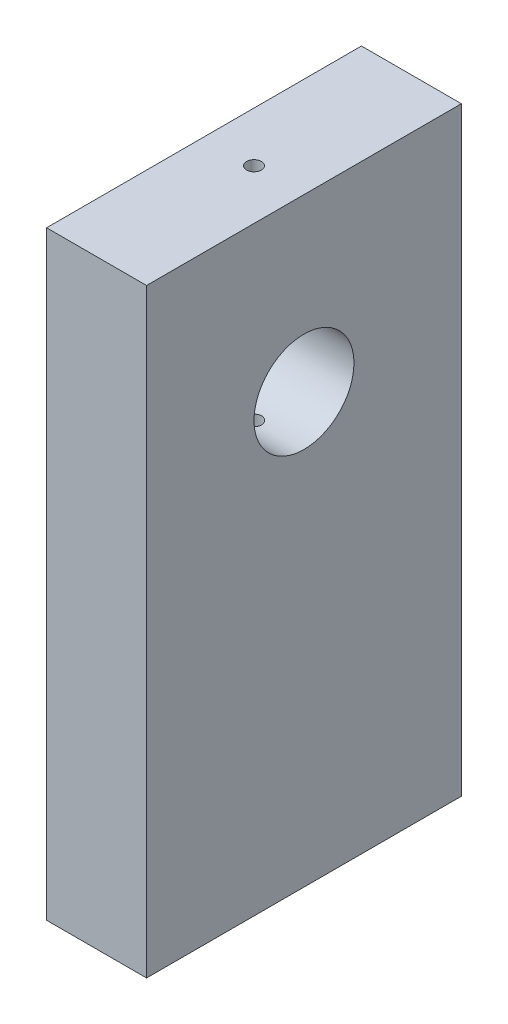
ISO-10303-21;
HEADER;
FILE_DESCRIPTION(('STEP AP214'),'2;1');
FILE_NAME('part.step','',(''),(''),'','','');
FILE_SCHEMA(('AUTOMOTIVE_DESIGN { 1 0 10303 214 1 1 1 1 }'));
ENDSEC;
DATA;
#1=APPLICATION_CONTEXT('core data for automotive mechanical design processes');
#2=APPLICATION_PROTOCOL_DEFINITION('international standard','automotive_design',2000,#1);
#3=PRODUCT_CONTEXT('',#1,'mechanical');
#4=PRODUCT('Part','Part','',(#3));
#5=PRODUCT_RELATED_PRODUCT_CATEGORY('part','',(#4));
#6=PRODUCT_DEFINITION_FORMATION('','',#4);
#7=PRODUCT_DEFINITION_CONTEXT('part definition',#1,'design');
#8=PRODUCT_DEFINITION('design','',#6,#7);
#9=PRODUCT_DEFINITION_SHAPE('','',#8);
#10=(LENGTH_UNIT() NAMED_UNIT(*) SI_UNIT(.MILLI.,.METRE.));
#11=(NAMED_UNIT(*) PLANE_ANGLE_UNIT() SI_UNIT($,.RADIAN.));
#12=(NAMED_UNIT(*) SI_UNIT($,.STERADIAN.) SOLID_ANGLE_UNIT());
#13=UNCERTAINTY_MEASURE_WITH_UNIT(LENGTH_MEASURE(1.E-05),#10,'distance_accuracy_value','');
#14=(GEOMETRIC_REPRESENTATION_CONTEXT(3) GLOBAL_UNCERTAINTY_ASSIGNED_CONTEXT((#13)) GLOBAL_UNIT_ASSIGNED_CONTEXT((#10,
#11,#12)) REPRESENTATION_CONTEXT('',''));
#15=CARTESIAN_POINT('',(0.,0.,0.));
#16=DIRECTION('',(0.,0.,1.));
#17=DIRECTION('',(1.,0.,0.));
#18=AXIS2_PLACEMENT_3D('',#15,#16,#17);
#19=CARTESIAN_POINT('',(0.,76.2,28.0311398221209));
#20=DIRECTION('',(1.,0.,0.));
#21=DIRECTION('',(0.,0.,-1.));
#22=AXIS2_PLACEMENT_3D('',#19,#20,#21);
#23=PLANE('',#22);
#24=CARTESIAN_POINT('',(0.,54.5,8.03113982212091));
#25=DIRECTION('',(1.,0.,0.));
#26=DIRECTION('',(0.,0.,-1.));
#27=AXIS2_PLACEMENT_3D('',#24,#25,#26);
#28=CIRCLE('',#27,6.35);
#29=CARTESIAN_POINT('',(0.,54.5,1.68113982212091));
#30=VERTEX_POINT('',#29);
#31=EDGE_CURVE('E108',#30,#30,#28,.T.);
#32=ORIENTED_EDGE('',*,*,#31,.T.);
#33=EDGE_LOOP('',(#32));
#34=FACE_BOUND('',#33,.T.);
#35=DIRECTION('',(0.,0.,1.));
#36=VECTOR('',#35,1.);
#37=CARTESIAN_POINT('',(0.,0.,28.0311398221209));
#38=LINE('',#37,#36);
#39=CARTESIAN_POINT('',(0.,0.,-11.9688601778791));
#40=VERTEX_POINT('',#39);
#41=CARTESIAN_POINT('',(0.,0.,28.0311398221209));
#42=VERTEX_POINT('',#41);
#43=EDGE_CURVE('E105',#40,#42,#38,.T.);
#44=ORIENTED_EDGE('',*,*,#43,.T.);
#45=DIRECTION('',(0.,-1.,0.));
#46=VECTOR('',#45,1.);
#47=CARTESIAN_POINT('',(0.,76.2,28.0311398221209));
#48=LINE('',#47,#46);
#49=CARTESIAN_POINT('',(0.,76.2,28.0311398221209));
#50=VERTEX_POINT('',#49);
#51=EDGE_CURVE('E11',#50,#42,#48,.T.);
#52=ORIENTED_EDGE('',*,*,#51,.F.);
#53=DIRECTION('',(0.,0.,1.));
#54=VECTOR('',#53,1.);
#55=CARTESIAN_POINT('',(0.,76.2,28.0311398221209));
#56=LINE('',#55,#54);
#57=CARTESIAN_POINT('',(0.,76.2,-11.9688601778791));
#58=VERTEX_POINT('',#57);
#59=EDGE_CURVE('E92',#58,#50,#56,.T.);
#60=ORIENTED_EDGE('',*,*,#59,.F.);
#61=DIRECTION('',(0.,-1.,0.));
#62=VECTOR('',#61,1.);
#63=CARTESIAN_POINT('',(0.,76.2,-11.9688601778791));
#64=LINE('',#63,#62);
#65=EDGE_CURVE('E101',#58,#40,#64,.T.);
#66=ORIENTED_EDGE('',*,*,#65,.T.);
#67=EDGE_LOOP('',(#44,#52,#60,#66));
#68=FACE_BOUND('',#67,.T.);
#69=ADVANCED_FACE('F34',(#34,#68),#23,.F.);
#70=CARTESIAN_POINT('',(0.,76.2,28.0311398221209));
#71=DIRECTION('',(0.,0.,-1.));
#72=DIRECTION('',(-1.,0.,0.));
#73=AXIS2_PLACEMENT_3D('',#70,#71,#72);
#74=PLANE('',#73);
#75=DIRECTION('',(1.,0.,0.));
#76=VECTOR('',#75,1.);
#77=CARTESIAN_POINT('',(0.,0.,28.0311398221209));
#78=LINE('',#77,#76);
#79=CARTESIAN_POINT('',(12.7,0.,28.0311398221209));
#80=VERTEX_POINT('',#79);
#81=EDGE_CURVE('E96',#42,#80,#78,.T.);
#82=ORIENTED_EDGE('',*,*,#81,.T.);
#83=DIRECTION('',(0.,-1.,0.));
#84=VECTOR('',#83,1.);
#85=CARTESIAN_POINT('',(12.7,76.2,28.0311398221209));
#86=LINE('',#85,#84);
#87=CARTESIAN_POINT('',(12.7,76.2,28.0311398221209));
#88=VERTEX_POINT('',#87);
#89=EDGE_CURVE('E48',#88,#80,#86,.T.);
#90=ORIENTED_EDGE('',*,*,#89,.F.);
#91=DIRECTION('',(1.,0.,0.));
#92=VECTOR('',#91,1.);
#93=CARTESIAN_POINT('',(0.,76.2,28.0311398221209));
#94=LINE('',#93,#92);
#95=EDGE_CURVE('E87',#50,#88,#94,.T.);
#96=ORIENTED_EDGE('',*,*,#95,.F.);
#97=ORIENTED_EDGE('',*,*,#51,.T.);
#98=EDGE_LOOP('',(#82,#90,#96,#97));
#99=FACE_BOUND('',#98,.T.);
#100=ADVANCED_FACE('F95',(#99),#74,.F.);
#101=CARTESIAN_POINT('',(12.7,76.2,28.0311398221209));
#102=DIRECTION('',(-1.,0.,0.));
#103=DIRECTION('',(0.,0.,1.));
#104=AXIS2_PLACEMENT_3D('',#101,#102,#103);
#105=PLANE('',#104);
#106=CARTESIAN_POINT('',(12.7,54.5,8.03113982212092));
#107=DIRECTION('',(1.,0.,0.));
#108=DIRECTION('',(0.,0.,-1.));
#109=AXIS2_PLACEMENT_3D('',#106,#107,#108);
#110=CIRCLE('',#109,6.35);
#111=CARTESIAN_POINT('',(12.7,54.5,1.68113982212092));
#112=VERTEX_POINT('',#111);
#113=EDGE_CURVE('E183',#112,#112,#110,.T.);
#114=ORIENTED_EDGE('',*,*,#113,.F.);
#115=EDGE_LOOP('',(#114));
#116=FACE_BOUND('',#115,.T.);
#117=DIRECTION('',(0.,0.,-1.));
#118=VECTOR('',#117,1.);
#119=CARTESIAN_POINT('',(12.7,0.,28.0311398221209));
#120=LINE('',#119,#118);
#121=CARTESIAN_POINT('',(12.7,0.,-11.9688601778791));
#122=VERTEX_POINT('',#121);
#123=EDGE_CURVE('E74',#80,#122,#120,.T.);
#124=ORIENTED_EDGE('',*,*,#123,.T.);
#125=DIRECTION('',(0.,-1.,0.));
#126=VECTOR('',#125,1.);
#127=CARTESIAN_POINT('',(12.7,76.2,-11.9688601778791));
#128=LINE('',#127,#126);
#129=CARTESIAN_POINT('',(12.7,76.2,-11.9688601778791));
#130=VERTEX_POINT('',#129);
#131=EDGE_CURVE('E97',#130,#122,#128,.T.);
#132=ORIENTED_EDGE('',*,*,#131,.F.);
#133=DIRECTION('',(0.,0.,-1.));
#134=VECTOR('',#133,1.);
#135=CARTESIAN_POINT('',(12.7,76.2,28.0311398221209));
#136=LINE('',#135,#134);
#137=EDGE_CURVE('E90',#88,#130,#136,.T.);
#138=ORIENTED_EDGE('',*,*,#137,.F.);
#139=ORIENTED_EDGE('',*,*,#89,.T.);
#140=EDGE_LOOP('',(#124,#132,#138,#139));
#141=FACE_BOUND('',#140,.T.);
#142=ADVANCED_FACE('F99',(#116,#141),#105,.F.);
#143=CARTESIAN_POINT('',(0.,76.2,-11.9688601778791));
#144=DIRECTION('',(0.,0.,1.));
#145=DIRECTION('',(1.,0.,0.));
#146=AXIS2_PLACEMENT_3D('',#143,#144,#145);
#147=PLANE('',#146);
#148=DIRECTION('',(-1.,0.,0.));
#149=VECTOR('',#148,1.);
#150=CARTESIAN_POINT('',(0.,0.,-11.9688601778791));
#151=LINE('',#150,#149);
#152=EDGE_CURVE('E80',#122,#40,#151,.T.);
#153=ORIENTED_EDGE('',*,*,#152,.T.);
#154=ORIENTED_EDGE('',*,*,#65,.F.);
#155=DIRECTION('',(-1.,0.,0.));
#156=VECTOR('',#155,1.);
#157=CARTESIAN_POINT('',(0.,76.2,-11.9688601778791));
#158=LINE('',#157,#156);
#159=EDGE_CURVE('E57',#130,#58,#158,.T.);
#160=ORIENTED_EDGE('',*,*,#159,.F.);
#161=ORIENTED_EDGE('',*,*,#131,.T.);
#162=EDGE_LOOP('',(#153,#154,#160,#161));
#163=FACE_BOUND('',#162,.T.);
#164=ADVANCED_FACE('F170',(#163),#147,.F.);
#165=CARTESIAN_POINT('',(0.,76.2,0.));
#166=DIRECTION('',(0.,-1.,0.));
#167=DIRECTION('',(0.,0.,-1.));
#168=AXIS2_PLACEMENT_3D('',#165,#166,#167);
#169=PLANE('',#168);
#170=CARTESIAN_POINT('',(6.35,76.2,8.03113982212091));
#171=DIRECTION('',(0.,1.,0.));
#172=DIRECTION('',(0.,0.,1.));
#173=AXIS2_PLACEMENT_3D('',#170,#171,#172);
#174=CIRCLE('',#173,0.95);
#175=CARTESIAN_POINT('',(6.35,76.2,8.98113982212091));
#176=VERTEX_POINT('',#175);
#177=EDGE_CURVE('E189',#176,#176,#174,.T.);
#178=ORIENTED_EDGE('',*,*,#177,.F.);
#179=EDGE_LOOP('',(#178));
#180=FACE_BOUND('',#179,.T.);
#181=ORIENTED_EDGE('',*,*,#59,.T.);
#182=ORIENTED_EDGE('',*,*,#95,.T.);
#183=ORIENTED_EDGE('',*,*,#137,.T.);
#184=ORIENTED_EDGE('',*,*,#159,.T.);
#185=EDGE_LOOP('',(#181,#182,#183,#184));
#186=FACE_BOUND('',#185,.T.);
#187=ADVANCED_FACE('F88',(#180,#186),#169,.F.);
#188=CARTESIAN_POINT('',(0.,0.,0.));
#189=DIRECTION('',(0.,-1.,0.));
#190=DIRECTION('',(0.,0.,-1.));
#191=AXIS2_PLACEMENT_3D('',#188,#189,#190);
#192=PLANE('',#191);
#193=CARTESIAN_POINT('',(6.35,0.,1.36413982212091));
#194=DIRECTION('',(0.,-1.,0.));
#195=DIRECTION('',(0.,0.,-1.));
#196=AXIS2_PLACEMENT_3D('',#193,#194,#195);
#197=CIRCLE('',#196,0.949999999999999);
#198=CARTESIAN_POINT('',(6.35,0.,0.414139822120907));
#199=VERTEX_POINT('',#198);
#200=EDGE_CURVE('E201',#199,#199,#197,.T.);
#201=ORIENTED_EDGE('',*,*,#200,.F.);
#202=EDGE_LOOP('',(#201));
#203=FACE_BOUND('',#202,.T.);
#204=CARTESIAN_POINT('',(6.35,0.,14.6981398221209));
#205=DIRECTION('',(0.,-1.,0.));
#206=DIRECTION('',(0.,0.,-1.));
#207=AXIS2_PLACEMENT_3D('',#204,#205,#206);
#208=CIRCLE('',#207,0.949999999999999);
#209=CARTESIAN_POINT('',(6.35,0.,13.7481398221209));
#210=VERTEX_POINT('',#209);
#211=EDGE_CURVE('E195',#210,#210,#208,.T.);
#212=ORIENTED_EDGE('',*,*,#211,.F.);
#213=EDGE_LOOP('',(#212));
#214=FACE_BOUND('',#213,.T.);
#215=ORIENTED_EDGE('',*,*,#43,.F.);
#216=ORIENTED_EDGE('',*,*,#152,.F.);
#217=ORIENTED_EDGE('',*,*,#123,.F.);
#218=ORIENTED_EDGE('',*,*,#81,.F.);
#219=EDGE_LOOP('',(#215,#216,#217,#218));
#220=FACE_BOUND('',#219,.T.);
#221=ADVANCED_FACE('F161',(#203,#214,#220),#192,.T.);
#222=CARTESIAN_POINT('',(0.,54.5,8.03113982212091));
#223=DIRECTION('',(1.,0.,0.));
#224=DIRECTION('',(0.,0.,-1.));
#225=AXIS2_PLACEMENT_3D('',#222,#223,#224);
#226=CYLINDRICAL_SURFACE('',#225,6.35);
#227=CARTESIAN_POINT('',(6.35,48.2214651390631,8.98113982212091));
#228=CARTESIAN_POINT('',(6.29695944050904,48.2214642541504,8.98113763017558));
#229=CARTESIAN_POINT('',(6.24388805166467,48.220785742529,8.9766827475789));
#230=CARTESIAN_POINT('',(6.13922897763603,48.2181468334334,8.95898558856856));
#231=CARTESIAN_POINT('',(6.08764279279286,48.2161851841202,8.94573473054591));
#232=CARTESIAN_POINT('',(5.98748419818778,48.2112070403444,8.91085083118381));
#233=CARTESIAN_POINT('',(5.93890951307246,48.2081913539881,8.88922420998365));
#234=CARTESIAN_POINT('',(5.84608536614171,48.2014458882347,8.83821777733549));
#235=CARTESIAN_POINT('',(5.80183530757803,48.1977162075713,8.80883903766573));
#236=CARTESIAN_POINT('',(5.71855717925139,48.1899297791387,8.7429124103493));
#237=CARTESIAN_POINT('',(5.67956854839338,48.1858708910181,8.70631495027158));
#238=CARTESIAN_POINT('',(5.60826177064337,48.1779024882952,8.6270967847413));
#239=CARTESIAN_POINT('',(5.57594398990584,48.1739929819018,8.58447574887853));
#240=CARTESIAN_POINT('',(5.51875085220531,48.1667414547173,8.49416771409972));
#241=CARTESIAN_POINT('',(5.49391180195969,48.1634022353278,8.44645747759593));
#242=CARTESIAN_POINT('',(5.45261420074565,48.1576912242777,8.34748393334747));
#243=CARTESIAN_POINT('',(5.43615520924314,48.1553193817641,8.29622081253655));
#244=CARTESIAN_POINT('',(5.41220446108994,48.1518254657755,8.19200278371624));
#245=CARTESIAN_POINT('',(5.40464667091787,48.1506941935128,8.13906336450344));
#246=CARTESIAN_POINT('',(5.39850783135176,48.1497773568818,8.03265648155445));
#247=CARTESIAN_POINT('',(5.3999262854261,48.1499917180781,7.97918904718939));
#248=CARTESIAN_POINT('',(5.41164754458788,48.1517346441019,7.8736943778446));
#249=CARTESIAN_POINT('',(5.42187930811867,48.1532526999295,7.82165905133832));
#250=CARTESIAN_POINT('',(5.45082523923659,48.1574207351315,7.72005231807688));
#251=CARTESIAN_POINT('',(5.46953962421231,48.160070743515,7.67048097450363));
#252=CARTESIAN_POINT('',(5.51499234173793,48.1662229877349,7.57499424718532));
#253=CARTESIAN_POINT('',(5.54176059569328,48.1697283921646,7.52909331881497));
#254=CARTESIAN_POINT('',(5.60253935391812,48.1772007296619,7.44240800089341));
#255=CARTESIAN_POINT('',(5.63655033244988,48.1811676929452,7.40162394667929));
#256=CARTESIAN_POINT('',(5.71124488252164,48.1891665270761,7.32591134629481));
#257=CARTESIAN_POINT('',(5.75199047700879,48.1931986532478,7.29104398795087));
#258=CARTESIAN_POINT('',(5.83878687652127,48.2008355018972,7.22863229814654));
#259=CARTESIAN_POINT('',(5.88483771389023,48.204440221769,7.20108801133496));
#260=CARTESIAN_POINT('',(5.98100100946922,48.2108140502121,7.15409615641868));
#261=CARTESIAN_POINT('',(6.03111657542702,48.2135825116228,7.13465485462588));
#262=CARTESIAN_POINT('',(6.13395223468854,48.2179588962068,7.10448227676795));
#263=CARTESIAN_POINT('',(6.18667214517011,48.2195669007195,7.0937503902305));
#264=CARTESIAN_POINT('',(6.29267563893605,48.2214248929145,7.08138515129504));
#265=CARTESIAN_POINT('',(6.34594888654339,48.2216878246573,7.07966507153335));
#266=CARTESIAN_POINT('',(6.45202290248653,48.2208602650969,7.08514216749058));
#267=CARTESIAN_POINT('',(6.5048236853527,48.2197698155611,7.09233906801737));
#268=CARTESIAN_POINT('',(6.60818541350141,48.2163702492639,7.1153722839069));
#269=CARTESIAN_POINT('',(6.6587562007361,48.2140672263866,7.13116541153345));
#270=CARTESIAN_POINT('',(6.75653276490395,48.2085070311314,7.17089785519443));
#271=CARTESIAN_POINT('',(6.80373837631714,48.2052498118606,7.19483757159413));
#272=CARTESIAN_POINT('',(6.89383342892606,48.1981177274387,7.2503920889631));
#273=CARTESIAN_POINT('',(6.93668788674272,48.1942384180548,7.28206304352649));
#274=CARTESIAN_POINT('',(7.01650457433138,48.1863126500114,7.35210293033033));
#275=CARTESIAN_POINT('',(7.05346647250281,48.1822661819612,7.39047223926262));
#276=CARTESIAN_POINT('',(7.12076017993331,48.1744215899789,7.47320156237177));
#277=CARTESIAN_POINT('',(7.15103452180125,48.1706258013322,7.51760857582116));
#278=CARTESIAN_POINT('',(7.20369340246693,48.1637465196142,7.61092833261962));
#279=CARTESIAN_POINT('',(7.22607815618529,48.1606630071407,7.65984095318545));
#280=CARTESIAN_POINT('',(7.26223056581287,48.155565941014,7.76060385634704));
#281=CARTESIAN_POINT('',(7.27602967346064,48.1535484862236,7.8124426487991));
#282=CARTESIAN_POINT('',(7.29472087942889,48.1507944755807,7.91773404616642));
#283=CARTESIAN_POINT('',(7.29961356280087,48.1500578355933,7.97118654484488));
#284=CARTESIAN_POINT('',(7.30033881254923,48.1499492894961,8.07763059720882));
#285=CARTESIAN_POINT('',(7.29625932045422,48.1505641366386,8.13062155920452));
#286=CARTESIAN_POINT('',(7.27934448116428,48.1530627741379,8.23515500323407));
#287=CARTESIAN_POINT('',(7.26650916155902,48.1549465604963,8.28669748983154));
#288=CARTESIAN_POINT('',(7.23247815291329,48.1597723880404,8.3868469443731));
#289=CARTESIAN_POINT('',(7.21128852144323,48.1627136623236,8.43545600991028));
#290=CARTESIAN_POINT('',(7.16115976267356,48.1693313620588,8.52844258764614));
#291=CARTESIAN_POINT('',(7.13222038643604,48.1730078111252,8.57281996385206));
#292=CARTESIAN_POINT('',(7.06709551290929,48.1807299691893,8.65652954804012));
#293=CARTESIAN_POINT('',(7.03084507650451,48.1847787967126,8.69581095123261));
#294=CARTESIAN_POINT('',(6.95226370620136,48.1927662855605,8.76776518260966));
#295=CARTESIAN_POINT('',(6.90993134702199,48.1967049208027,8.80043645739562));
#296=CARTESIAN_POINT('',(6.8201097644222,48.2040496791568,8.85840681111266));
#297=CARTESIAN_POINT('',(6.77259304742203,48.2074527037419,8.88366367587567));
#298=CARTESIAN_POINT('',(6.67396349208461,48.2133046055472,8.9258003726782));
#299=CARTESIAN_POINT('',(6.62285445210588,48.2157544731937,8.94268890528006));
#300=CARTESIAN_POINT('',(6.53459609651562,48.2188561873119,8.96377316812267));
#301=CARTESIAN_POINT('',(6.49799208756663,48.2198293621235,8.97027570869853));
#302=CARTESIAN_POINT('',(6.42426375307134,48.2211341436864,8.97895977532955));
#303=CARTESIAN_POINT('',(6.3871394342208,48.2214657586862,8.98114135693898));
#304=CARTESIAN_POINT('',(6.35,48.2214651390631,8.98113982212091));
#305=B_SPLINE_CURVE_WITH_KNOTS('',3,(#227,#228,#229,#230,#231,#232,#233,#234,#235,#236,#237,
#238,#239,#240,#241,#242,#243,#244,#245,#246,#247,#248,#249,#250,#251,#252,#253,#254,#255,#256,
#257,#258,#259,#260,#261,#262,#263,#264,#265,#266,#267,#268,#269,#270,#271,#272,#273,#274,#275,
#276,#277,#278,#279,#280,#281,#282,#283,#284,#285,#286,#287,#288,#289,#290,#291,#292,#293,#294,
#295,#296,#297,#298,#299,#300,#301,#302,#303,#304),.UNSPECIFIED.,.T.,.F.,(4,2,2,2,2,2,2,2,2,2,2,
2,2,2,2,2,2,2,2,2,2,2,2,2,2,2,2,2,2,2,2,2,2,2,2,2,2,2,4),(0.,0.158985930727143,
0.318127201168327,0.477146728266471,0.636144281442417,0.796274307839144,0.956413121233524,
1.11731726432722,1.27821294792418,1.43790735502968,1.5975929285267,1.75600324109659,
1.91441761356022,2.07342794436333,2.23244869055634,2.39302513833747,2.55360256513159,
2.71430394249025,2.87499405477368,3.03413484682635,3.1932707276647,3.3516143864918,
3.50996582826474,3.6695035437727,3.82905023401156,3.98991876845858,4.15078292033991,
4.31105425545261,4.47131506216836,4.63001206571959,4.78870856921767,4.94729021555862,
5.10587695648277,5.26593981086267,5.42604023687997,5.58703526585524,5.74786255508318,
5.85918723736514,5.97051048834403),.UNSPECIFIED.);
#306=CARTESIAN_POINT('',(6.35,48.2214651390631,8.98113982212091));
#307=VERTEX_POINT('',#306);
#308=EDGE_CURVE('E37',#307,#307,#305,.T.);
#309=ORIENTED_EDGE('',*,*,#308,.T.);
#310=EDGE_LOOP('',(#309));
#311=FACE_BOUND('',#310,.T.);
#312=CARTESIAN_POINT('',(6.35,60.7785348609369,8.98113982212091));
#313=CARTESIAN_POINT('',(6.40304055949096,60.7785357458496,8.98113763017558));
#314=CARTESIAN_POINT('',(6.45611194833533,60.779214257471,8.9766827475789));
#315=CARTESIAN_POINT('',(6.56077102236397,60.7818531665665,8.95898558856856));
#316=CARTESIAN_POINT('',(6.61235720720714,60.7838148158798,8.94573473054591));
#317=CARTESIAN_POINT('',(6.71251580181222,60.7887929596556,8.91085083118381));
#318=CARTESIAN_POINT('',(6.76109048692754,60.7918086460119,8.88922420998365));
#319=CARTESIAN_POINT('',(6.85391463385829,60.7985541117652,8.83821777733549));
#320=CARTESIAN_POINT('',(6.89816469242197,60.8022837924287,8.80883903766573));
#321=CARTESIAN_POINT('',(6.98144282074861,60.8100702208613,8.7429124103493));
#322=CARTESIAN_POINT('',(7.02043145160661,60.8141291089819,8.70631495027158));
#323=CARTESIAN_POINT('',(7.09173822935663,60.8220975117048,8.6270967847413));
#324=CARTESIAN_POINT('',(7.12405601009416,60.8260070180982,8.58447574887853));
#325=CARTESIAN_POINT('',(7.18124914779469,60.8332585452827,8.49416771409972));
#326=CARTESIAN_POINT('',(7.20608819804031,60.8365977646722,8.44645747759593));
#327=CARTESIAN_POINT('',(7.24738579925435,60.8423087757223,8.34748393334747));
#328=CARTESIAN_POINT('',(7.26384479075686,60.8446806182359,8.29622081253655));
#329=CARTESIAN_POINT('',(7.28779553891006,60.8481745342245,8.19200278371624));
#330=CARTESIAN_POINT('',(7.29535332908213,60.8493058064872,8.13906336450344));
#331=CARTESIAN_POINT('',(7.30149216864824,60.8502226431182,8.03265648155445));
#332=CARTESIAN_POINT('',(7.3000737145739,60.8500082819219,7.97918904718939));
#333=CARTESIAN_POINT('',(7.28835245541212,60.8482653558981,7.8736943778446));
#334=CARTESIAN_POINT('',(7.27812069188133,60.8467473000705,7.82165905133832));
#335=CARTESIAN_POINT('',(7.24917476076341,60.8425792648684,7.72005231807688));
#336=CARTESIAN_POINT('',(7.23046037578769,60.839929256485,7.67048097450363));
#337=CARTESIAN_POINT('',(7.18500765826207,60.8337770122651,7.57499424718532));
#338=CARTESIAN_POINT('',(7.15823940430672,60.8302716078354,7.52909331881497));
#339=CARTESIAN_POINT('',(7.09746064608188,60.8227992703381,7.44240800089341));
#340=CARTESIAN_POINT('',(7.06344966755012,60.8188323070548,7.40162394667929));
#341=CARTESIAN_POINT('',(6.98875511747836,60.8108334729239,7.32591134629481));
#342=CARTESIAN_POINT('',(6.94800952299121,60.8068013467522,7.29104398795087));
#343=CARTESIAN_POINT('',(6.86121312347873,60.7991644981028,7.22863229814654));
#344=CARTESIAN_POINT('',(6.81516228610977,60.795559778231,7.20108801133496));
#345=CARTESIAN_POINT('',(6.71899899053078,60.7891859497879,7.15409615641868));
#346=CARTESIAN_POINT('',(6.66888342457298,60.7864174883772,7.13465485462588));
#347=CARTESIAN_POINT('',(6.56604776531146,60.7820411037932,7.10448227676795));
#348=CARTESIAN_POINT('',(6.51332785482989,60.7804330992805,7.0937503902305));
#349=CARTESIAN_POINT('',(6.40732436106395,60.7785751070855,7.08138515129504));
#350=CARTESIAN_POINT('',(6.35405111345661,60.7783121753427,7.07966507153335));
#351=CARTESIAN_POINT('',(6.24797709751346,60.7791397349031,7.08514216749058));
#352=CARTESIAN_POINT('',(6.1951763146473,60.7802301844388,7.09233906801737));
#353=CARTESIAN_POINT('',(6.09181458649859,60.7836297507361,7.1153722839069));
#354=CARTESIAN_POINT('',(6.0412437992639,60.7859327736134,7.13116541153345));
#355=CARTESIAN_POINT('',(5.94346723509605,60.7914929688685,7.17089785519443));
#356=CARTESIAN_POINT('',(5.89626162368286,60.7947501881393,7.19483757159413));
#357=CARTESIAN_POINT('',(5.80616657107394,60.8018822725613,7.2503920889631));
#358=CARTESIAN_POINT('',(5.76331211325728,60.8057615819451,7.28206304352649));
#359=CARTESIAN_POINT('',(5.68349542566862,60.8136873499886,7.35210293033033));
#360=CARTESIAN_POINT('',(5.64653352749719,60.8177338180388,7.39047223926262));
#361=CARTESIAN_POINT('',(5.57923982006669,60.825578410021,7.47320156237177));
#362=CARTESIAN_POINT('',(5.54896547819875,60.8293741986678,7.51760857582116));
#363=CARTESIAN_POINT('',(5.49630659753307,60.8362534803858,7.61092833261962));
#364=CARTESIAN_POINT('',(5.47392184381471,60.8393369928593,7.65984095318545));
#365=CARTESIAN_POINT('',(5.43776943418713,60.844434058986,7.76060385634704));
#366=CARTESIAN_POINT('',(5.42397032653936,60.8464515137764,7.8124426487991));
#367=CARTESIAN_POINT('',(5.40527912057111,60.8492055244193,7.91773404616642));
#368=CARTESIAN_POINT('',(5.40038643719913,60.8499421644067,7.97118654484488));
#369=CARTESIAN_POINT('',(5.39966118745077,60.8500507105039,8.07763059720882));
#370=CARTESIAN_POINT('',(5.40374067954578,60.8494358633614,8.13062155920452));
#371=CARTESIAN_POINT('',(5.42065551883572,60.8469372258621,8.23515500323407));
#372=CARTESIAN_POINT('',(5.43349083844098,60.8450534395037,8.28669748983154));
#373=CARTESIAN_POINT('',(5.46752184708671,60.8402276119596,8.3868469443731));
#374=CARTESIAN_POINT('',(5.48871147855677,60.8372863376764,8.43545600991028));
#375=CARTESIAN_POINT('',(5.53884023732644,60.8306686379412,8.52844258764614));
#376=CARTESIAN_POINT('',(5.56777961356396,60.8269921888748,8.57281996385206));
#377=CARTESIAN_POINT('',(5.63290448709071,60.8192700308107,8.65652954804012));
#378=CARTESIAN_POINT('',(5.66915492349549,60.8152212032874,8.69581095123261));
#379=CARTESIAN_POINT('',(5.74773629379864,60.8072337144395,8.76776518260966));
#380=CARTESIAN_POINT('',(5.79006865297801,60.8032950791973,8.80043645739562));
#381=CARTESIAN_POINT('',(5.8798902355778,60.7959503208431,8.85840681111266));
#382=CARTESIAN_POINT('',(5.92740695257797,60.7925472962581,8.88366367587567));
#383=CARTESIAN_POINT('',(6.02603650791539,60.7866953944528,8.9258003726782));
#384=CARTESIAN_POINT('',(6.07714554789412,60.7842455268062,8.94268890528006));
#385=CARTESIAN_POINT('',(6.16540390348438,60.7811438126881,8.96377316812267));
#386=CARTESIAN_POINT('',(6.20200791243337,60.7801706378765,8.97027570869853));
#387=CARTESIAN_POINT('',(6.27573624692866,60.7788658563136,8.97895977532955));
#388=CARTESIAN_POINT('',(6.3128605657792,60.7785342413138,8.98114135693898));
#389=CARTESIAN_POINT('',(6.35,60.7785348609369,8.98113982212091));
#390=B_SPLINE_CURVE_WITH_KNOTS('',3,(#312,#313,#314,#315,#316,#317,#318,#319,#320,#321,#322,
#323,#324,#325,#326,#327,#328,#329,#330,#331,#332,#333,#334,#335,#336,#337,#338,#339,#340,#341,
#342,#343,#344,#345,#346,#347,#348,#349,#350,#351,#352,#353,#354,#355,#356,#357,#358,#359,#360,
#361,#362,#363,#364,#365,#366,#367,#368,#369,#370,#371,#372,#373,#374,#375,#376,#377,#378,#379,
#380,#381,#382,#383,#384,#385,#386,#387,#388,#389),.UNSPECIFIED.,.T.,.F.,(4,2,2,2,2,2,2,2,2,2,2,
2,2,2,2,2,2,2,2,2,2,2,2,2,2,2,2,2,2,2,2,2,2,2,2,2,2,2,4),(0.,0.158985930727143,
0.318127201168327,0.47714672826647,0.636144281442417,0.796274307839144,0.956413121233524,
1.11731726432722,1.27821294792418,1.43790735502968,1.5975929285267,1.75600324109659,
1.91441761356022,2.07342794436333,2.23244869055634,2.39302513833747,2.55360256513159,
2.71430394249025,2.87499405477368,3.03413484682635,3.1932707276647,3.3516143864918,
3.50996582826474,3.6695035437727,3.82905023401156,3.98991876845858,4.15078292033991,
4.31105425545261,4.47131506216836,4.63001206571959,4.78870856921767,4.94729021555862,
5.10587695648277,5.26593981086267,5.42604023687997,5.58703526585524,5.74786255508318,
5.85918723736514,5.97051048834403),.UNSPECIFIED.);
#391=CARTESIAN_POINT('',(6.35,60.7785348609369,8.98113982212091));
#392=VERTEX_POINT('',#391);
#393=EDGE_CURVE('E113',#392,#392,#390,.T.);
#394=ORIENTED_EDGE('',*,*,#393,.T.);
#395=EDGE_LOOP('',(#394));
#396=FACE_BOUND('',#395,.T.);
#397=ORIENTED_EDGE('',*,*,#31,.F.);
#398=EDGE_LOOP('',(#397));
#399=FACE_BOUND('',#398,.T.);
#400=ORIENTED_EDGE('',*,*,#113,.T.);
#401=EDGE_LOOP('',(#400));
#402=FACE_BOUND('',#401,.T.);
#403=ADVANCED_FACE('F119',(#311,#396,#399,#402),#226,.F.);
#404=CARTESIAN_POINT('',(6.35,46.2,8.03113982212091));
#405=DIRECTION('',(0.,1.,0.));
#406=DIRECTION('',(0.,0.,1.));
#407=AXIS2_PLACEMENT_3D('',#404,#405,#406);
#408=CYLINDRICAL_SURFACE('',#407,0.95);
#409=ORIENTED_EDGE('',*,*,#177,.T.);
#410=EDGE_LOOP('',(#409));
#411=FACE_BOUND('',#410,.T.);
#412=ORIENTED_EDGE('',*,*,#393,.F.);
#413=EDGE_LOOP('',(#412));
#414=FACE_BOUND('',#413,.T.);
#415=ADVANCED_FACE('F127',(#411,#414),#408,.F.);
#416=CARTESIAN_POINT('',(6.35,46.2,8.03113982212091));
#417=DIRECTION('',(0.,1.,0.));
#418=DIRECTION('',(0.,0.,1.));
#419=AXIS2_PLACEMENT_3D('',#416,#417,#418);
#420=CIRCLE('',#419,0.95);
#421=CARTESIAN_POINT('',(6.35,46.2,8.98113982212091));
#422=VERTEX_POINT('',#421);
#423=EDGE_CURVE('E118',#422,#422,#420,.T.);
#424=ORIENTED_EDGE('',*,*,#423,.F.);
#425=EDGE_LOOP('',(#424));
#426=FACE_BOUND('',#425,.T.);
#427=ORIENTED_EDGE('',*,*,#308,.F.);
#428=EDGE_LOOP('',(#427));
#429=FACE_BOUND('',#428,.T.);
#430=ADVANCED_FACE('F122',(#426,#429),#408,.F.);
#431=CARTESIAN_POINT('',(6.35,46.2,8.03113982212091));
#432=DIRECTION('',(0.,1.,0.));
#433=DIRECTION('',(0.,0.,1.));
#434=AXIS2_PLACEMENT_3D('',#431,#432,#433);
#435=PLANE('',#434);
#436=ORIENTED_EDGE('',*,*,#423,.T.);
#437=EDGE_LOOP('',(#436));
#438=FACE_BOUND('',#437,.T.);
#439=ADVANCED_FACE('F126',(#438),#435,.T.);
#440=CARTESIAN_POINT('',(6.35,21.,14.6981398221209));
#441=DIRECTION('',(0.,-1.,0.));
#442=DIRECTION('',(0.,0.,-1.));
#443=AXIS2_PLACEMENT_3D('',#440,#441,#442);
#444=CYLINDRICAL_SURFACE('',#443,0.949999999999999);
#445=CARTESIAN_POINT('',(6.35,21.,14.6981398221209));
#446=DIRECTION('',(0.,-1.,0.));
#447=DIRECTION('',(0.,0.,-1.));
#448=AXIS2_PLACEMENT_3D('',#445,#446,#447);
#449=CIRCLE('',#448,0.949999999999999);
#450=CARTESIAN_POINT('',(6.35,21.,13.7481398221209));
#451=VERTEX_POINT('',#450);
#452=EDGE_CURVE('E192',#451,#451,#449,.T.);
#453=ORIENTED_EDGE('',*,*,#452,.F.);
#454=EDGE_LOOP('',(#453));
#455=FACE_BOUND('',#454,.T.);
#456=ORIENTED_EDGE('',*,*,#211,.T.);
#457=EDGE_LOOP('',(#456));
#458=FACE_BOUND('',#457,.T.);
#459=ADVANCED_FACE('F132',(#455,#458),#444,.F.);
#460=CARTESIAN_POINT('',(6.35,21.,14.6981398221209));
#461=DIRECTION('',(0.,-1.,0.));
#462=DIRECTION('',(0.,0.,-1.));
#463=AXIS2_PLACEMENT_3D('',#460,#461,#462);
#464=PLANE('',#463);
#465=ORIENTED_EDGE('',*,*,#452,.T.);
#466=EDGE_LOOP('',(#465));
#467=FACE_BOUND('',#466,.T.);
#468=ADVANCED_FACE('F136',(#467),#464,.T.);
#469=CARTESIAN_POINT('',(6.35,21.,1.36413982212091));
#470=DIRECTION('',(0.,-1.,0.));
#471=DIRECTION('',(0.,0.,-1.));
#472=AXIS2_PLACEMENT_3D('',#469,#470,#471);
#473=CYLINDRICAL_SURFACE('',#472,0.949999999999999);
#474=CARTESIAN_POINT('',(6.35,21.,1.36413982212091));
#475=DIRECTION('',(0.,-1.,0.));
#476=DIRECTION('',(0.,0.,-1.));
#477=AXIS2_PLACEMENT_3D('',#474,#475,#476);
#478=CIRCLE('',#477,0.949999999999999);
#479=CARTESIAN_POINT('',(6.35,21.,0.414139822120907));
#480=VERTEX_POINT('',#479);
#481=EDGE_CURVE('E198',#480,#480,#478,.T.);
#482=ORIENTED_EDGE('',*,*,#481,.F.);
#483=EDGE_LOOP('',(#482));
#484=FACE_BOUND('',#483,.T.);
#485=ORIENTED_EDGE('',*,*,#200,.T.);
#486=EDGE_LOOP('',(#485));
#487=FACE_BOUND('',#486,.T.);
#488=ADVANCED_FACE('F140',(#484,#487),#473,.F.);
#489=CARTESIAN_POINT('',(6.35,21.,1.36413982212091));
#490=DIRECTION('',(0.,-1.,0.));
#491=DIRECTION('',(0.,0.,-1.));
#492=AXIS2_PLACEMENT_3D('',#489,#490,#491);
#493=PLANE('',#492);
#494=ORIENTED_EDGE('',*,*,#481,.T.);
#495=EDGE_LOOP('',(#494));
#496=FACE_BOUND('',#495,.T.);
#497=ADVANCED_FACE('F144',(#496),#493,.T.);
#498=CLOSED_SHELL('',(#69,#100,#142,#164,#187,#221,#403,#415,#430,#439,#459,#468,#488,#497));
#499=MANIFOLD_SOLID_BREP('B2',#498);
#500=ADVANCED_BREP_SHAPE_REPRESENTATION('',(#18,#499),#14);
#501=SHAPE_DEFINITION_REPRESENTATION(#9,#500);
ENDSEC;
END-ISO-10303-21;
